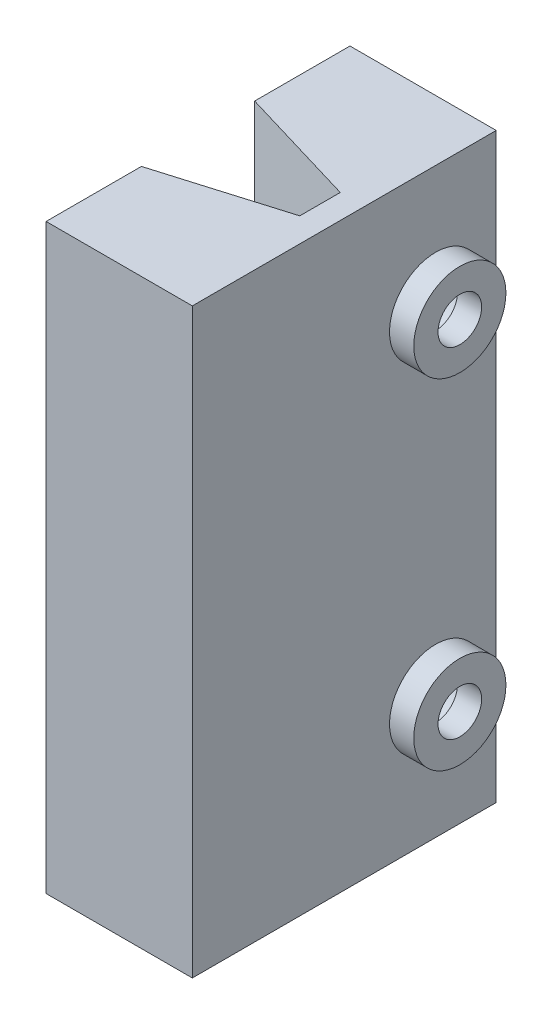
ISO-10303-21;
HEADER;
FILE_DESCRIPTION(('STEP AP214'),'2;1');
FILE_NAME('part.step','',(''),(''),'','','');
FILE_SCHEMA(('AUTOMOTIVE_DESIGN { 1 0 10303 214 1 1 1 1 }'));
ENDSEC;
DATA;
#1=APPLICATION_CONTEXT('core data for automotive mechanical design processes');
#2=APPLICATION_PROTOCOL_DEFINITION('international standard','automotive_design',2000,#1);
#3=PRODUCT_CONTEXT('',#1,'mechanical');
#4=PRODUCT('Part','Part','',(#3));
#5=PRODUCT_RELATED_PRODUCT_CATEGORY('part','',(#4));
#6=PRODUCT_DEFINITION_FORMATION('','',#4);
#7=PRODUCT_DEFINITION_CONTEXT('part definition',#1,'design');
#8=PRODUCT_DEFINITION('design','',#6,#7);
#9=PRODUCT_DEFINITION_SHAPE('','',#8);
#10=(LENGTH_UNIT() NAMED_UNIT(*) SI_UNIT(.MILLI.,.METRE.));
#11=(NAMED_UNIT(*) PLANE_ANGLE_UNIT() SI_UNIT($,.RADIAN.));
#12=(NAMED_UNIT(*) SI_UNIT($,.STERADIAN.) SOLID_ANGLE_UNIT());
#13=UNCERTAINTY_MEASURE_WITH_UNIT(LENGTH_MEASURE(1.E-05),#10,'distance_accuracy_value','');
#14=(GEOMETRIC_REPRESENTATION_CONTEXT(3) GLOBAL_UNCERTAINTY_ASSIGNED_CONTEXT((#13)) GLOBAL_UNIT_ASSIGNED_CONTEXT((#10,
#11,#12)) REPRESENTATION_CONTEXT('',''));
#15=CARTESIAN_POINT('',(0.,0.,0.));
#16=DIRECTION('',(0.,0.,1.));
#17=DIRECTION('',(1.,0.,0.));
#18=AXIS2_PLACEMENT_3D('',#15,#16,#17);
#19=CARTESIAN_POINT('',(-1.03,24.,1.785));
#20=DIRECTION('',(1.,0.,0.));
#21=DIRECTION('',(0.,0.,-1.));
#22=AXIS2_PLACEMENT_3D('',#19,#20,#21);
#23=PLANE('',#22);
#24=DIRECTION('',(0.,1.,0.));
#25=VECTOR('',#24,1.);
#26=CARTESIAN_POINT('',(-1.03,-6.,3.285));
#27=LINE('',#26,#25);
#28=CARTESIAN_POINT('',(-1.03,0.,3.285));
#29=VERTEX_POINT('',#28);
#30=CARTESIAN_POINT('',(-1.03,24.,3.285));
#31=VERTEX_POINT('',#30);
#32=EDGE_CURVE('E125',#29,#31,#27,.T.);
#33=ORIENTED_EDGE('',*,*,#32,.F.);
#34=DIRECTION('',(0.,0.,1.));
#35=VECTOR('',#34,1.);
#36=CARTESIAN_POINT('',(-1.03,0.,1.785));
#37=LINE('',#36,#35);
#38=CARTESIAN_POINT('',(-1.03,0.,7.215));
#39=VERTEX_POINT('',#38);
#40=EDGE_CURVE('E82',#29,#39,#37,.T.);
#41=ORIENTED_EDGE('',*,*,#40,.T.);
#42=DIRECTION('',(0.,-1.,0.));
#43=VECTOR('',#42,1.);
#44=CARTESIAN_POINT('',(-1.03,24.,7.215));
#45=LINE('',#44,#43);
#46=CARTESIAN_POINT('',(-1.03,24.,7.215));
#47=VERTEX_POINT('',#46);
#48=EDGE_CURVE('E129',#47,#39,#45,.T.);
#49=ORIENTED_EDGE('',*,*,#48,.F.);
#50=DIRECTION('',(0.,0.,1.));
#51=VECTOR('',#50,1.);
#52=CARTESIAN_POINT('',(-1.03,24.,1.785));
#53=LINE('',#52,#51);
#54=EDGE_CURVE('E56',#31,#47,#53,.T.);
#55=ORIENTED_EDGE('',*,*,#54,.F.);
#56=EDGE_LOOP('',(#33,#41,#49,#55));
#57=FACE_BOUND('',#56,.T.);
#58=ADVANCED_FACE('F33',(#57),#23,.F.);
#59=CARTESIAN_POINT('',(0.,24.,0.));
#60=DIRECTION('',(0.,1.,0.));
#61=DIRECTION('',(0.,0.,1.));
#62=AXIS2_PLACEMENT_3D('',#59,#60,#61);
#63=PLANE('',#62);
#64=DIRECTION('',(-0.958296914540683,0.,-0.285774427795432));
#65=VECTOR('',#64,1.);
#66=CARTESIAN_POINT('',(0.295174567799963,24.,-0.989818717355876));
#67=LINE('',#66,#65);
#68=CARTESIAN_POINT('',(4.,24.,0.115));
#69=VERTEX_POINT('',#68);
#70=CARTESIAN_POINT('',(-1.03,24.,-1.385));
#71=VERTEX_POINT('',#70);
#72=EDGE_CURVE('E110',#69,#71,#67,.T.);
#73=ORIENTED_EDGE('',*,*,#72,.F.);
#74=DIRECTION('',(0.,0.,1.));
#75=VECTOR('',#74,1.);
#76=CARTESIAN_POINT('',(4.,24.,0.115));
#77=LINE('',#76,#75);
#78=CARTESIAN_POINT('',(4.,24.,1.785));
#79=VERTEX_POINT('',#78);
#80=EDGE_CURVE('E121',#69,#79,#77,.T.);
#81=ORIENTED_EDGE('',*,*,#80,.T.);
#82=DIRECTION('',(-0.958296914540683,0.,0.285774427795432));
#83=VECTOR('',#82,1.);
#84=CARTESIAN_POINT('',(0.815502397380848,24.,2.73465137255044));
#85=LINE('',#84,#83);
#86=EDGE_CURVE('E168',#79,#31,#85,.T.);
#87=ORIENTED_EDGE('',*,*,#86,.T.);
#88=ORIENTED_EDGE('',*,*,#54,.T.);
#89=DIRECTION('',(1.,0.,0.));
#90=VECTOR('',#89,1.);
#91=CARTESIAN_POINT('',(5.,24.,7.215));
#92=LINE('',#91,#90);
#93=CARTESIAN_POINT('',(5.,24.,7.215));
#94=VERTEX_POINT('',#93);
#95=EDGE_CURVE('E149',#47,#94,#92,.T.);
#96=ORIENTED_EDGE('',*,*,#95,.T.);
#97=DIRECTION('',(0.,0.,-1.));
#98=VECTOR('',#97,1.);
#99=CARTESIAN_POINT('',(5.,24.,-5.315));
#100=LINE('',#99,#98);
#101=CARTESIAN_POINT('',(5.,24.,-5.315));
#102=VERTEX_POINT('',#101);
#103=EDGE_CURVE('E90',#94,#102,#100,.T.);
#104=ORIENTED_EDGE('',*,*,#103,.T.);
#105=DIRECTION('',(-1.,0.,0.));
#106=VECTOR('',#105,1.);
#107=CARTESIAN_POINT('',(0.758759528759529,24.,-5.315));
#108=LINE('',#107,#106);
#109=CARTESIAN_POINT('',(-1.03,24.,-5.315));
#110=VERTEX_POINT('',#109);
#111=EDGE_CURVE('E131',#102,#110,#108,.T.);
#112=ORIENTED_EDGE('',*,*,#111,.T.);
#113=DIRECTION('',(0.,0.,1.));
#114=VECTOR('',#113,1.);
#115=CARTESIAN_POINT('',(-1.03,24.,-5.315));
#116=LINE('',#115,#114);
#117=EDGE_CURVE('E124',#110,#71,#116,.T.);
#118=ORIENTED_EDGE('',*,*,#117,.T.);
#119=EDGE_LOOP('',(#73,#81,#87,#88,#96,#104,#112,#118));
#120=FACE_BOUND('',#119,.T.);
#121=ADVANCED_FACE('F120',(#120),#63,.T.);
#122=CARTESIAN_POINT('',(0.,0.,0.));
#123=DIRECTION('',(0.,1.,0.));
#124=DIRECTION('',(0.,0.,1.));
#125=AXIS2_PLACEMENT_3D('',#122,#123,#124);
#126=PLANE('',#125);
#127=DIRECTION('',(0.,0.,1.));
#128=VECTOR('',#127,1.);
#129=CARTESIAN_POINT('',(4.,0.,0.115));
#130=LINE('',#129,#128);
#131=CARTESIAN_POINT('',(4.,0.,0.115));
#132=VERTEX_POINT('',#131);
#133=CARTESIAN_POINT('',(4.,0.,1.785));
#134=VERTEX_POINT('',#133);
#135=EDGE_CURVE('E144',#132,#134,#130,.T.);
#136=ORIENTED_EDGE('',*,*,#135,.F.);
#137=DIRECTION('',(-0.958296914540683,0.,-0.285774427795432));
#138=VECTOR('',#137,1.);
#139=CARTESIAN_POINT('',(0.295174567799963,0.,-0.989818717355876));
#140=LINE('',#139,#138);
#141=CARTESIAN_POINT('',(-1.03,0.,-1.385));
#142=VERTEX_POINT('',#141);
#143=EDGE_CURVE('E11',#132,#142,#140,.T.);
#144=ORIENTED_EDGE('',*,*,#143,.T.);
#145=DIRECTION('',(0.,0.,1.));
#146=VECTOR('',#145,1.);
#147=CARTESIAN_POINT('',(-1.03,0.,-5.315));
#148=LINE('',#147,#146);
#149=CARTESIAN_POINT('',(-1.03,0.,-5.315));
#150=VERTEX_POINT('',#149);
#151=EDGE_CURVE('E141',#150,#142,#148,.T.);
#152=ORIENTED_EDGE('',*,*,#151,.F.);
#153=DIRECTION('',(-1.,0.,0.));
#154=VECTOR('',#153,1.);
#155=CARTESIAN_POINT('',(-1.03,0.,-5.315));
#156=LINE('',#155,#154);
#157=CARTESIAN_POINT('',(5.,0.,-5.315));
#158=VERTEX_POINT('',#157);
#159=EDGE_CURVE('E138',#158,#150,#156,.T.);
#160=ORIENTED_EDGE('',*,*,#159,.F.);
#161=DIRECTION('',(0.,0.,-1.));
#162=VECTOR('',#161,1.);
#163=CARTESIAN_POINT('',(5.,0.,-5.315));
#164=LINE('',#163,#162);
#165=CARTESIAN_POINT('',(5.,0.,7.215));
#166=VERTEX_POINT('',#165);
#167=EDGE_CURVE('E135',#166,#158,#164,.T.);
#168=ORIENTED_EDGE('',*,*,#167,.F.);
#169=DIRECTION('',(1.,0.,0.));
#170=VECTOR('',#169,1.);
#171=CARTESIAN_POINT('',(-1.03,0.,7.215));
#172=LINE('',#171,#170);
#173=EDGE_CURVE('E147',#39,#166,#172,.T.);
#174=ORIENTED_EDGE('',*,*,#173,.F.);
#175=ORIENTED_EDGE('',*,*,#40,.F.);
#176=DIRECTION('',(-0.958296914540683,0.,0.285774427795432));
#177=VECTOR('',#176,1.);
#178=CARTESIAN_POINT('',(0.815502397380848,0.,2.73465137255044));
#179=LINE('',#178,#177);
#180=EDGE_CURVE('E41',#134,#29,#179,.T.);
#181=ORIENTED_EDGE('',*,*,#180,.F.);
#182=EDGE_LOOP('',(#136,#144,#152,#160,#168,#174,#175,#181));
#183=FACE_BOUND('',#182,.T.);
#184=ADVANCED_FACE('F171',(#183),#126,.F.);
#185=CARTESIAN_POINT('',(5.,24.,-5.315));
#186=DIRECTION('',(-1.,0.,0.));
#187=DIRECTION('',(0.,0.,1.));
#188=AXIS2_PLACEMENT_3D('',#185,#186,#187);
#189=PLANE('',#188);
#190=CARTESIAN_POINT('',(5.,19.,-2.815));
#191=DIRECTION('',(-1.,0.,0.));
#192=DIRECTION('',(0.,0.,1.));
#193=AXIS2_PLACEMENT_3D('',#190,#191,#192);
#194=CIRCLE('',#193,1.9);
#195=CARTESIAN_POINT('',(5.,19.,-0.915000000000002));
#196=VERTEX_POINT('',#195);
#197=EDGE_CURVE('E162',#196,#196,#194,.F.);
#198=ORIENTED_EDGE('',*,*,#197,.F.);
#199=EDGE_LOOP('',(#198));
#200=FACE_BOUND('',#199,.T.);
#201=CARTESIAN_POINT('',(5.,5.,-2.815));
#202=DIRECTION('',(-1.,0.,0.));
#203=DIRECTION('',(0.,0.,1.));
#204=AXIS2_PLACEMENT_3D('',#201,#202,#203);
#205=CIRCLE('',#204,1.9);
#206=CARTESIAN_POINT('',(5.,5.,-0.915));
#207=VERTEX_POINT('',#206);
#208=EDGE_CURVE('E159',#207,#207,#205,.F.);
#209=ORIENTED_EDGE('',*,*,#208,.F.);
#210=EDGE_LOOP('',(#209));
#211=FACE_BOUND('',#210,.T.);
#212=ORIENTED_EDGE('',*,*,#167,.T.);
#213=DIRECTION('',(0.,-1.,0.));
#214=VECTOR('',#213,1.);
#215=CARTESIAN_POINT('',(5.,24.,-5.315));
#216=LINE('',#215,#214);
#217=EDGE_CURVE('E154',#102,#158,#216,.T.);
#218=ORIENTED_EDGE('',*,*,#217,.F.);
#219=ORIENTED_EDGE('',*,*,#103,.F.);
#220=DIRECTION('',(0.,-1.,0.));
#221=VECTOR('',#220,1.);
#222=CARTESIAN_POINT('',(5.,24.,7.215));
#223=LINE('',#222,#221);
#224=EDGE_CURVE('E157',#94,#166,#223,.T.);
#225=ORIENTED_EDGE('',*,*,#224,.T.);
#226=EDGE_LOOP('',(#212,#218,#219,#225));
#227=FACE_BOUND('',#226,.T.);
#228=ADVANCED_FACE('F35',(#200,#211,#227),#189,.F.);
#229=CARTESIAN_POINT('',(-1.03,24.,-5.315));
#230=DIRECTION('',(0.,0.,1.));
#231=DIRECTION('',(1.,0.,0.));
#232=AXIS2_PLACEMENT_3D('',#229,#230,#231);
#233=PLANE('',#232);
#234=ORIENTED_EDGE('',*,*,#159,.T.);
#235=DIRECTION('',(0.,-1.,0.));
#236=VECTOR('',#235,1.);
#237=CARTESIAN_POINT('',(-1.03,24.,-5.315));
#238=LINE('',#237,#236);
#239=EDGE_CURVE('E115',#110,#150,#238,.T.);
#240=ORIENTED_EDGE('',*,*,#239,.F.);
#241=ORIENTED_EDGE('',*,*,#111,.F.);
#242=ORIENTED_EDGE('',*,*,#217,.T.);
#243=EDGE_LOOP('',(#234,#240,#241,#242));
#244=FACE_BOUND('',#243,.T.);
#245=ADVANCED_FACE('F183',(#244),#233,.F.);
#246=CARTESIAN_POINT('',(-1.03,24.,-5.315));
#247=DIRECTION('',(1.,0.,0.));
#248=DIRECTION('',(0.,0.,-1.));
#249=AXIS2_PLACEMENT_3D('',#246,#247,#248);
#250=PLANE('',#249);
#251=ORIENTED_EDGE('',*,*,#151,.T.);
#252=DIRECTION('',(0.,1.,0.));
#253=VECTOR('',#252,1.);
#254=CARTESIAN_POINT('',(-1.03,-6.,-1.385));
#255=LINE('',#254,#253);
#256=EDGE_CURVE('E48',#142,#71,#255,.T.);
#257=ORIENTED_EDGE('',*,*,#256,.T.);
#258=ORIENTED_EDGE('',*,*,#117,.F.);
#259=ORIENTED_EDGE('',*,*,#239,.T.);
#260=EDGE_LOOP('',(#251,#257,#258,#259));
#261=FACE_BOUND('',#260,.T.);
#262=ADVANCED_FACE('F186',(#261),#250,.F.);
#263=CARTESIAN_POINT('',(4.,24.,0.115));
#264=DIRECTION('',(1.,0.,0.));
#265=DIRECTION('',(0.,0.,-1.));
#266=AXIS2_PLACEMENT_3D('',#263,#264,#265);
#267=PLANE('',#266);
#268=ORIENTED_EDGE('',*,*,#135,.T.);
#269=DIRECTION('',(0.,-1.,0.));
#270=VECTOR('',#269,1.);
#271=CARTESIAN_POINT('',(4.,24.,1.785));
#272=LINE('',#271,#270);
#273=EDGE_CURVE('E116',#79,#134,#272,.T.);
#274=ORIENTED_EDGE('',*,*,#273,.F.);
#275=ORIENTED_EDGE('',*,*,#80,.F.);
#276=DIRECTION('',(0.,-1.,0.));
#277=VECTOR('',#276,1.);
#278=CARTESIAN_POINT('',(4.,24.,0.115));
#279=LINE('',#278,#277);
#280=EDGE_CURVE('E107',#69,#132,#279,.T.);
#281=ORIENTED_EDGE('',*,*,#280,.T.);
#282=EDGE_LOOP('',(#268,#274,#275,#281));
#283=FACE_BOUND('',#282,.T.);
#284=ADVANCED_FACE('F127',(#283),#267,.F.);
#285=CARTESIAN_POINT('',(-1.03,24.,7.215));
#286=DIRECTION('',(0.,0.,-1.));
#287=DIRECTION('',(-1.,0.,0.));
#288=AXIS2_PLACEMENT_3D('',#285,#286,#287);
#289=PLANE('',#288);
#290=ORIENTED_EDGE('',*,*,#173,.T.);
#291=ORIENTED_EDGE('',*,*,#224,.F.);
#292=ORIENTED_EDGE('',*,*,#95,.F.);
#293=ORIENTED_EDGE('',*,*,#48,.T.);
#294=EDGE_LOOP('',(#290,#291,#292,#293));
#295=FACE_BOUND('',#294,.T.);
#296=ADVANCED_FACE('F175',(#295),#289,.F.);
#297=CARTESIAN_POINT('',(6.,5.,-2.815));
#298=DIRECTION('',(1.,0.,0.));
#299=DIRECTION('',(0.,0.,-1.));
#300=AXIS2_PLACEMENT_3D('',#297,#298,#299);
#301=PLANE('',#300);
#302=CARTESIAN_POINT('',(6.,5.,-2.815));
#303=DIRECTION('',(1.,0.,0.));
#304=DIRECTION('',(0.,0.,-1.));
#305=AXIS2_PLACEMENT_3D('',#302,#303,#304);
#306=CIRCLE('',#305,1.9);
#307=CARTESIAN_POINT('',(6.,5.,-4.715));
#308=VERTEX_POINT('',#307);
#309=EDGE_CURVE('E139',#308,#308,#306,.T.);
#310=ORIENTED_EDGE('',*,*,#309,.T.);
#311=EDGE_LOOP('',(#310));
#312=FACE_BOUND('',#311,.T.);
#313=CARTESIAN_POINT('',(6.,5.,-2.815));
#314=DIRECTION('',(1.,0.,0.));
#315=DIRECTION('',(0.,0.,-1.));
#316=AXIS2_PLACEMENT_3D('',#313,#314,#315);
#317=CIRCLE('',#316,0.9);
#318=CARTESIAN_POINT('',(6.,5.,-3.715));
#319=VERTEX_POINT('',#318);
#320=EDGE_CURVE('E212',#319,#319,#317,.T.);
#321=ORIENTED_EDGE('',*,*,#320,.F.);
#322=EDGE_LOOP('',(#321));
#323=FACE_BOUND('',#322,.T.);
#324=ADVANCED_FACE('F233',(#312,#323),#301,.T.);
#325=CARTESIAN_POINT('',(6.,5.,-2.815));
#326=DIRECTION('',(-1.,0.,0.));
#327=DIRECTION('',(0.,0.,1.));
#328=AXIS2_PLACEMENT_3D('',#325,#326,#327);
#329=CYLINDRICAL_SURFACE('',#328,1.9);
#330=ORIENTED_EDGE('',*,*,#309,.F.);
#331=EDGE_LOOP('',(#330));
#332=FACE_BOUND('',#331,.T.);
#333=ORIENTED_EDGE('',*,*,#208,.T.);
#334=EDGE_LOOP('',(#333));
#335=FACE_BOUND('',#334,.T.);
#336=ADVANCED_FACE('F223',(#332,#335),#329,.T.);
#337=CARTESIAN_POINT('',(6.,5.,-2.815));
#338=DIRECTION('',(-1.,0.,0.));
#339=DIRECTION('',(0.,0.,1.));
#340=AXIS2_PLACEMENT_3D('',#337,#338,#339);
#341=CYLINDRICAL_SURFACE('',#340,0.9);
#342=ORIENTED_EDGE('',*,*,#320,.T.);
#343=EDGE_LOOP('',(#342));
#344=FACE_BOUND('',#343,.T.);
#345=CARTESIAN_POINT('',(5.,5.,-2.815));
#346=DIRECTION('',(1.,0.,0.));
#347=DIRECTION('',(0.,0.,-1.));
#348=AXIS2_PLACEMENT_3D('',#345,#346,#347);
#349=CIRCLE('',#348,0.9);
#350=CARTESIAN_POINT('',(5.,5.,-3.715));
#351=VERTEX_POINT('',#350);
#352=EDGE_CURVE('E207',#351,#351,#349,.T.);
#353=ORIENTED_EDGE('',*,*,#352,.F.);
#354=EDGE_LOOP('',(#353));
#355=FACE_BOUND('',#354,.T.);
#356=ADVANCED_FACE('F220',(#344,#355),#341,.F.);
#357=CARTESIAN_POINT('',(6.,19.,-2.815));
#358=DIRECTION('',(1.,0.,0.));
#359=DIRECTION('',(0.,0.,-1.));
#360=AXIS2_PLACEMENT_3D('',#357,#358,#359);
#361=PLANE('',#360);
#362=CARTESIAN_POINT('',(6.,19.,-2.815));
#363=DIRECTION('',(1.,0.,0.));
#364=DIRECTION('',(0.,0.,-1.));
#365=AXIS2_PLACEMENT_3D('',#362,#363,#364);
#366=CIRCLE('',#365,1.9);
#367=CARTESIAN_POINT('',(6.,19.,-4.715));
#368=VERTEX_POINT('',#367);
#369=EDGE_CURVE('E206',#368,#368,#366,.T.);
#370=ORIENTED_EDGE('',*,*,#369,.T.);
#371=EDGE_LOOP('',(#370));
#372=FACE_BOUND('',#371,.T.);
#373=CARTESIAN_POINT('',(6.,19.,-2.815));
#374=DIRECTION('',(1.,0.,0.));
#375=DIRECTION('',(0.,0.,-1.));
#376=AXIS2_PLACEMENT_3D('',#373,#374,#375);
#377=CIRCLE('',#376,0.9);
#378=CARTESIAN_POINT('',(6.,19.,-3.715));
#379=VERTEX_POINT('',#378);
#380=EDGE_CURVE('E203',#379,#379,#377,.T.);
#381=ORIENTED_EDGE('',*,*,#380,.F.);
#382=EDGE_LOOP('',(#381));
#383=FACE_BOUND('',#382,.T.);
#384=ADVANCED_FACE('F222',(#372,#383),#361,.T.);
#385=CARTESIAN_POINT('',(6.,19.,-2.815));
#386=DIRECTION('',(-1.,0.,0.));
#387=DIRECTION('',(0.,0.,1.));
#388=AXIS2_PLACEMENT_3D('',#385,#386,#387);
#389=CYLINDRICAL_SURFACE('',#388,1.9);
#390=ORIENTED_EDGE('',*,*,#369,.F.);
#391=EDGE_LOOP('',(#390));
#392=FACE_BOUND('',#391,.T.);
#393=ORIENTED_EDGE('',*,*,#197,.T.);
#394=EDGE_LOOP('',(#393));
#395=FACE_BOUND('',#394,.T.);
#396=ADVANCED_FACE('F230',(#392,#395),#389,.T.);
#397=CARTESIAN_POINT('',(6.,19.,-2.815));
#398=DIRECTION('',(-1.,0.,0.));
#399=DIRECTION('',(0.,0.,1.));
#400=AXIS2_PLACEMENT_3D('',#397,#398,#399);
#401=CYLINDRICAL_SURFACE('',#400,0.9);
#402=ORIENTED_EDGE('',*,*,#380,.T.);
#403=EDGE_LOOP('',(#402));
#404=FACE_BOUND('',#403,.T.);
#405=CARTESIAN_POINT('',(5.,19.,-2.815));
#406=DIRECTION('',(1.,0.,0.));
#407=DIRECTION('',(0.,0.,-1.));
#408=AXIS2_PLACEMENT_3D('',#405,#406,#407);
#409=CIRCLE('',#408,0.9);
#410=CARTESIAN_POINT('',(5.,19.,-3.715));
#411=VERTEX_POINT('',#410);
#412=EDGE_CURVE('E197',#411,#411,#409,.T.);
#413=ORIENTED_EDGE('',*,*,#412,.F.);
#414=EDGE_LOOP('',(#413));
#415=FACE_BOUND('',#414,.T.);
#416=ADVANCED_FACE('F264',(#404,#415),#401,.F.);
#417=CARTESIAN_POINT('',(1.,19.,-2.815));
#418=DIRECTION('',(1.,0.,0.));
#419=DIRECTION('',(0.,0.,-1.));
#420=AXIS2_PLACEMENT_3D('',#417,#418,#419);
#421=CYLINDRICAL_SURFACE('',#420,1.15);
#422=CARTESIAN_POINT('',(1.,19.,-2.815));
#423=DIRECTION('',(1.,0.,0.));
#424=DIRECTION('',(0.,0.,-1.));
#425=AXIS2_PLACEMENT_3D('',#422,#423,#424);
#426=CIRCLE('',#425,1.15);
#427=CARTESIAN_POINT('',(1.,19.,-3.965));
#428=VERTEX_POINT('',#427);
#429=EDGE_CURVE('E194',#428,#428,#426,.T.);
#430=ORIENTED_EDGE('',*,*,#429,.F.);
#431=EDGE_LOOP('',(#430));
#432=FACE_BOUND('',#431,.T.);
#433=CARTESIAN_POINT('',(5.,19.,-2.815));
#434=DIRECTION('',(1.,0.,0.));
#435=DIRECTION('',(0.,0.,-1.));
#436=AXIS2_PLACEMENT_3D('',#433,#434,#435);
#437=CIRCLE('',#436,1.15);
#438=CARTESIAN_POINT('',(5.,19.,-3.965));
#439=VERTEX_POINT('',#438);
#440=EDGE_CURVE('E198',#439,#439,#437,.T.);
#441=ORIENTED_EDGE('',*,*,#440,.T.);
#442=EDGE_LOOP('',(#441));
#443=FACE_BOUND('',#442,.T.);
#444=ADVANCED_FACE('F269',(#432,#443),#421,.F.);
#445=CARTESIAN_POINT('',(1.,19.,-2.815));
#446=DIRECTION('',(1.,0.,0.));
#447=DIRECTION('',(0.,0.,-1.));
#448=AXIS2_PLACEMENT_3D('',#445,#446,#447);
#449=PLANE('',#448);
#450=ORIENTED_EDGE('',*,*,#429,.T.);
#451=EDGE_LOOP('',(#450));
#452=FACE_BOUND('',#451,.T.);
#453=ADVANCED_FACE('F287',(#452),#449,.T.);
#454=CARTESIAN_POINT('',(5.,19.,-2.815));
#455=DIRECTION('',(1.,0.,0.));
#456=DIRECTION('',(0.,0.,-1.));
#457=AXIS2_PLACEMENT_3D('',#454,#455,#456);
#458=PLANE('',#457);
#459=ORIENTED_EDGE('',*,*,#412,.T.);
#460=EDGE_LOOP('',(#459));
#461=FACE_BOUND('',#460,.T.);
#462=ORIENTED_EDGE('',*,*,#440,.F.);
#463=EDGE_LOOP('',(#462));
#464=FACE_BOUND('',#463,.T.);
#465=ADVANCED_FACE('F278',(#461,#464),#458,.F.);
#466=CARTESIAN_POINT('',(1.,5.,-2.815));
#467=DIRECTION('',(1.,0.,0.));
#468=DIRECTION('',(0.,0.,-1.));
#469=AXIS2_PLACEMENT_3D('',#466,#467,#468);
#470=CYLINDRICAL_SURFACE('',#469,1.15);
#471=CARTESIAN_POINT('',(1.,5.,-2.815));
#472=DIRECTION('',(1.,0.,0.));
#473=DIRECTION('',(0.,0.,-1.));
#474=AXIS2_PLACEMENT_3D('',#471,#472,#473);
#475=CIRCLE('',#474,1.15);
#476=CARTESIAN_POINT('',(1.,5.,-3.965));
#477=VERTEX_POINT('',#476);
#478=EDGE_CURVE('E190',#477,#477,#475,.T.);
#479=ORIENTED_EDGE('',*,*,#478,.F.);
#480=EDGE_LOOP('',(#479));
#481=FACE_BOUND('',#480,.T.);
#482=CARTESIAN_POINT('',(5.,5.,-2.815));
#483=DIRECTION('',(1.,0.,0.));
#484=DIRECTION('',(0.,0.,-1.));
#485=AXIS2_PLACEMENT_3D('',#482,#483,#484);
#486=CIRCLE('',#485,1.15);
#487=CARTESIAN_POINT('',(5.,5.,-3.965));
#488=VERTEX_POINT('',#487);
#489=EDGE_CURVE('E187',#488,#488,#486,.T.);
#490=ORIENTED_EDGE('',*,*,#489,.T.);
#491=EDGE_LOOP('',(#490));
#492=FACE_BOUND('',#491,.T.);
#493=ADVANCED_FACE('F274',(#481,#492),#470,.F.);
#494=CARTESIAN_POINT('',(1.,5.,-2.815));
#495=DIRECTION('',(1.,0.,0.));
#496=DIRECTION('',(0.,0.,-1.));
#497=AXIS2_PLACEMENT_3D('',#494,#495,#496);
#498=PLANE('',#497);
#499=ORIENTED_EDGE('',*,*,#478,.T.);
#500=EDGE_LOOP('',(#499));
#501=FACE_BOUND('',#500,.T.);
#502=ADVANCED_FACE('F277',(#501),#498,.T.);
#503=CARTESIAN_POINT('',(5.,5.,-2.815));
#504=DIRECTION('',(1.,0.,0.));
#505=DIRECTION('',(0.,0.,-1.));
#506=AXIS2_PLACEMENT_3D('',#503,#504,#505);
#507=PLANE('',#506);
#508=ORIENTED_EDGE('',*,*,#352,.T.);
#509=EDGE_LOOP('',(#508));
#510=FACE_BOUND('',#509,.T.);
#511=ORIENTED_EDGE('',*,*,#489,.F.);
#512=EDGE_LOOP('',(#511));
#513=FACE_BOUND('',#512,.T.);
#514=ADVANCED_FACE('F217',(#510,#513),#507,.F.);
#515=CARTESIAN_POINT('',(0.815502397380848,-6.,2.73465137255044));
#516=DIRECTION('',(-0.285774427795432,0.,-0.958296914540683));
#517=DIRECTION('',(-0.958296914540683,0.,0.285774427795432));
#518=AXIS2_PLACEMENT_3D('',#515,#516,#517);
#519=PLANE('',#518);
#520=ORIENTED_EDGE('',*,*,#180,.T.);
#521=ORIENTED_EDGE('',*,*,#32,.T.);
#522=ORIENTED_EDGE('',*,*,#86,.F.);
#523=ORIENTED_EDGE('',*,*,#273,.T.);
#524=EDGE_LOOP('',(#520,#521,#522,#523));
#525=FACE_BOUND('',#524,.T.);
#526=ADVANCED_FACE('F166',(#525),#519,.T.);
#527=CARTESIAN_POINT('',(0.295174567799963,-6.,-0.989818717355876));
#528=DIRECTION('',(0.285774427795432,0.,-0.958296914540683));
#529=DIRECTION('',(-0.958296914540683,0.,-0.285774427795432));
#530=AXIS2_PLACEMENT_3D('',#527,#528,#529);
#531=PLANE('',#530);
#532=ORIENTED_EDGE('',*,*,#280,.F.);
#533=ORIENTED_EDGE('',*,*,#72,.T.);
#534=ORIENTED_EDGE('',*,*,#256,.F.);
#535=ORIENTED_EDGE('',*,*,#143,.F.);
#536=EDGE_LOOP('',(#532,#533,#534,#535));
#537=FACE_BOUND('',#536,.T.);
#538=ADVANCED_FACE('F109',(#537),#531,.F.);
#539=CLOSED_SHELL('',(#58,#121,#184,#228,#245,#262,#284,#296,#324,#336,#356,#384,#396,#416,#444,
#453,#465,#493,#502,#514,#526,#538));
#540=MANIFOLD_SOLID_BREP('B2',#539);
#541=ADVANCED_BREP_SHAPE_REPRESENTATION('',(#18,#540),#14);
#542=SHAPE_DEFINITION_REPRESENTATION(#9,#541);
ENDSEC;
END-ISO-10303-21;
